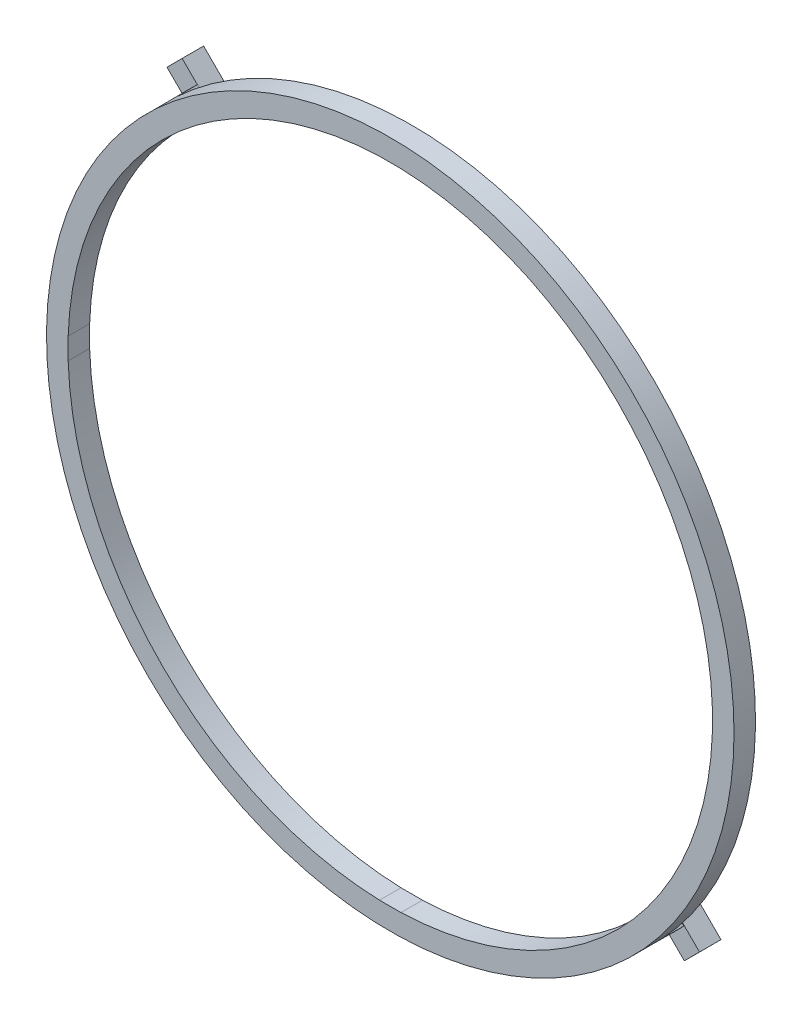
ISO-10303-21;
HEADER;
FILE_DESCRIPTION(('STEP AP214'),'2;1');
FILE_NAME('part.step','',(''),(''),'','','');
FILE_SCHEMA(('AUTOMOTIVE_DESIGN { 1 0 10303 214 1 1 1 1 }'));
ENDSEC;
DATA;
#1=APPLICATION_CONTEXT('core data for automotive mechanical design processes');
#2=APPLICATION_PROTOCOL_DEFINITION('international standard','automotive_design',2000,#1);
#3=PRODUCT_CONTEXT('',#1,'mechanical');
#4=PRODUCT('Part','Part','',(#3));
#5=PRODUCT_RELATED_PRODUCT_CATEGORY('part','',(#4));
#6=PRODUCT_DEFINITION_FORMATION('','',#4);
#7=PRODUCT_DEFINITION_CONTEXT('part definition',#1,'design');
#8=PRODUCT_DEFINITION('design','',#6,#7);
#9=PRODUCT_DEFINITION_SHAPE('','',#8);
#10=(LENGTH_UNIT() NAMED_UNIT(*) SI_UNIT(.MILLI.,.METRE.));
#11=(NAMED_UNIT(*) PLANE_ANGLE_UNIT() SI_UNIT($,.RADIAN.));
#12=(NAMED_UNIT(*) SI_UNIT($,.STERADIAN.) SOLID_ANGLE_UNIT());
#13=UNCERTAINTY_MEASURE_WITH_UNIT(LENGTH_MEASURE(1.E-05),#10,'distance_accuracy_value','');
#14=(GEOMETRIC_REPRESENTATION_CONTEXT(3) GLOBAL_UNCERTAINTY_ASSIGNED_CONTEXT((#13)) GLOBAL_UNIT_ASSIGNED_CONTEXT((#10,
#11,#12)) REPRESENTATION_CONTEXT('',''));
#15=CARTESIAN_POINT('',(0.,0.,0.));
#16=DIRECTION('',(0.,0.,1.));
#17=DIRECTION('',(1.,0.,0.));
#18=AXIS2_PLACEMENT_3D('',#15,#16,#17);
#19=CARTESIAN_POINT('',(0.,0.,-1.));
#20=DIRECTION('',(0.,0.,1.));
#21=DIRECTION('',(-1.,0.,0.));
#22=AXIS2_PLACEMENT_3D('',#19,#20,#21);
#23=PLANE('',#22);
#24=DIRECTION('',(-0.708582944932962,0.705627529331255,0.));
#25=VECTOR('',#24,1.);
#26=CARTESIAN_POINT('',(-0.352837552032621,-0.354315359463311,-1.));
#27=LINE('',#26,#25);
#28=CARTESIAN_POINT('',(10.9789516636038,-11.6388410234117,-1.));
#29=VERTEX_POINT('',#28);
#30=CARTESIAN_POINT('',(10.2699993262344,-10.932845642336,-1.));
#31=VERTEX_POINT('',#30);
#32=EDGE_CURVE('E11',#29,#31,#27,.T.);
#33=ORIENTED_EDGE('',*,*,#32,.F.);
#34=CARTESIAN_POINT('',(0.,0.,-1.));
#35=DIRECTION('',(0.,0.,1.));
#36=DIRECTION('',(-1.,0.,0.));
#37=AXIS2_PLACEMENT_3D('',#34,#35,#36);
#38=CIRCLE('',#37,16.);
#39=CARTESIAN_POINT('',(10.9546659479833,-11.6617020184918,-1.));
#40=VERTEX_POINT('',#39);
#41=EDGE_CURVE('E233',#40,#29,#38,.T.);
#42=ORIENTED_EDGE('',*,*,#41,.F.);
#43=DIRECTION('',(0.684666621748957,-0.728856376155735,0.));
#44=VECTOR('',#43,1.);
#45=CARTESIAN_POINT('',(10.9546659479833,-11.6617020184918,-1.));
#46=LINE('',#45,#44);
#47=EDGE_CURVE('E245',#31,#40,#46,.T.);
#48=ORIENTED_EDGE('',*,*,#47,.F.);
#49=EDGE_LOOP('',(#33,#42,#48));
#50=FACE_BOUND('',#49,.T.);
#51=ADVANCED_FACE('F39',(#50),#23,.F.);
#52=CARTESIAN_POINT('',(0.,0.,0.));
#53=DIRECTION('',(0.,0.,1.));
#54=DIRECTION('',(1.,0.,0.));
#55=AXIS2_PLACEMENT_3D('',#52,#53,#54);
#56=PLANE('',#55);
#57=CARTESIAN_POINT('',(0.,0.,0.));
#58=DIRECTION('',(0.,0.,1.));
#59=DIRECTION('',(1.,0.,0.));
#60=AXIS2_PLACEMENT_3D('',#57,#58,#59);
#61=CIRCLE('',#60,15.);
#62=CARTESIAN_POINT('',(0.5,-14.9916643505649,0.));
#63=VERTEX_POINT('',#62);
#64=CARTESIAN_POINT('',(10.2699993262344,-10.932845642336,0.));
#65=VERTEX_POINT('',#64);
#66=EDGE_CURVE('E392',#63,#65,#61,.T.);
#67=ORIENTED_EDGE('',*,*,#66,.T.);
#68=DIRECTION('',(0.684666621748957,-0.728856376155735,0.));
#69=VECTOR('',#68,1.);
#70=CARTESIAN_POINT('',(10.9546659479833,-11.6617020184918,0.));
#71=LINE('',#70,#69);
#72=CARTESIAN_POINT('',(10.9546659479833,-11.6617020184918,0.));
#73=VERTEX_POINT('',#72);
#74=EDGE_CURVE('E227',#65,#73,#71,.T.);
#75=ORIENTED_EDGE('',*,*,#74,.T.);
#76=CARTESIAN_POINT('',(0.,0.,0.));
#77=DIRECTION('',(0.,0.,1.));
#78=DIRECTION('',(1.,0.,0.));
#79=AXIS2_PLACEMENT_3D('',#76,#77,#78);
#80=CIRCLE('',#79,16.);
#81=CARTESIAN_POINT('',(-11.6617705183814,10.9545930265168,0.));
#82=VERTEX_POINT('',#81);
#83=EDGE_CURVE('E435',#82,#73,#80,.T.);
#84=ORIENTED_EDGE('',*,*,#83,.F.);
#85=DIRECTION('',(0.684666621748958,-0.728856376155735,0.));
#86=VECTOR('',#85,1.);
#87=CARTESIAN_POINT('',(-11.6617705183814,10.9545930265168,0.));
#88=LINE('',#87,#86);
#89=CARTESIAN_POINT('',(-10.9756744302996,10.2242149234094,0.));
#90=VERTEX_POINT('',#89);
#91=EDGE_CURVE('E310',#82,#90,#88,.T.);
#92=ORIENTED_EDGE('',*,*,#91,.T.);
#93=CARTESIAN_POINT('',(0.,0.,0.));
#94=DIRECTION('',(0.,0.,1.));
#95=DIRECTION('',(1.,0.,0.));
#96=AXIS2_PLACEMENT_3D('',#93,#94,#95);
#97=CIRCLE('',#96,15.);
#98=CARTESIAN_POINT('',(-14.9916643505649,0.499999999999996,0.));
#99=VERTEX_POINT('',#98);
#100=EDGE_CURVE('E339',#90,#99,#97,.T.);
#101=ORIENTED_EDGE('',*,*,#100,.T.);
#102=DIRECTION('',(0.,-1.,0.));
#103=VECTOR('',#102,1.);
#104=CARTESIAN_POINT('',(-14.9916643505649,-0.500000000000003,0.));
#105=LINE('',#104,#103);
#106=CARTESIAN_POINT('',(-14.9916643505649,-0.5,0.));
#107=VERTEX_POINT('',#106);
#108=EDGE_CURVE('E379',#99,#107,#105,.T.);
#109=ORIENTED_EDGE('',*,*,#108,.T.);
#110=CARTESIAN_POINT('',(0.,0.,0.));
#111=DIRECTION('',(0.,0.,1.));
#112=DIRECTION('',(1.,0.,0.));
#113=AXIS2_PLACEMENT_3D('',#110,#111,#112);
#114=CIRCLE('',#113,15.);
#115=CARTESIAN_POINT('',(-0.499999999999996,-14.9916643505649,0.));
#116=VERTEX_POINT('',#115);
#117=EDGE_CURVE('E383',#107,#116,#114,.T.);
#118=ORIENTED_EDGE('',*,*,#117,.T.);
#119=DIRECTION('',(1.,0.,0.));
#120=VECTOR('',#119,1.);
#121=CARTESIAN_POINT('',(-0.499999999999996,-14.9916643505649,0.));
#122=LINE('',#121,#120);
#123=EDGE_CURVE('E387',#116,#63,#122,.T.);
#124=ORIENTED_EDGE('',*,*,#123,.T.);
#125=EDGE_LOOP('',(#67,#75,#84,#92,#101,#109,#118,#124));
#126=FACE_BOUND('',#125,.T.);
#127=ADVANCED_FACE('F471',(#126),#56,.F.);
#128=CARTESIAN_POINT('',(0.,0.,-1.));
#129=DIRECTION('',(0.,0.,1.));
#130=DIRECTION('',(1.,0.,0.));
#131=AXIS2_PLACEMENT_3D('',#128,#129,#130);
#132=PLANE('',#131);
#133=DIRECTION('',(0.708582944932962,-0.705627529331255,0.));
#134=VECTOR('',#133,1.);
#135=CARTESIAN_POINT('',(-10.2699993262344,10.932845642336,-1.));
#136=LINE('',#135,#134);
#137=CARTESIAN_POINT('',(-10.9789516636038,11.6388410234117,-1.));
#138=VERTEX_POINT('',#137);
#139=CARTESIAN_POINT('',(-10.2699993262344,10.932845642336,-1.));
#140=VERTEX_POINT('',#139);
#141=EDGE_CURVE('E48',#138,#140,#136,.T.);
#142=ORIENTED_EDGE('',*,*,#141,.F.);
#143=CARTESIAN_POINT('',(0.,0.,-1.));
#144=DIRECTION('',(0.,0.,1.));
#145=DIRECTION('',(1.,0.,0.));
#146=AXIS2_PLACEMENT_3D('',#143,#144,#145);
#147=CIRCLE('',#146,16.);
#148=CARTESIAN_POINT('',(-10.9546659479833,11.6617020184918,-1.));
#149=VERTEX_POINT('',#148);
#150=EDGE_CURVE('E311',#149,#138,#147,.T.);
#151=ORIENTED_EDGE('',*,*,#150,.F.);
#152=DIRECTION('',(-0.684666621748957,0.728856376155735,0.));
#153=VECTOR('',#152,1.);
#154=CARTESIAN_POINT('',(-10.9546659479833,11.6617020184918,-1.));
#155=LINE('',#154,#153);
#156=EDGE_CURVE('E324',#140,#149,#155,.T.);
#157=ORIENTED_EDGE('',*,*,#156,.F.);
#158=EDGE_LOOP('',(#142,#151,#157));
#159=FACE_BOUND('',#158,.T.);
#160=ADVANCED_FACE('F533',(#159),#132,.F.);
#161=CARTESIAN_POINT('',(0.,0.,1.));
#162=DIRECTION('',(0.,0.,1.));
#163=DIRECTION('',(1.,0.,0.));
#164=AXIS2_PLACEMENT_3D('',#161,#162,#163);
#165=PLANE('',#164);
#166=CARTESIAN_POINT('',(0.,0.,1.));
#167=DIRECTION('',(0.,0.,1.));
#168=DIRECTION('',(1.,0.,0.));
#169=AXIS2_PLACEMENT_3D('',#166,#167,#168);
#170=CIRCLE('',#169,16.);
#171=CARTESIAN_POINT('',(16.,0.,1.));
#172=VERTEX_POINT('',#171);
#173=EDGE_CURVE('E432',#172,#172,#170,.T.);
#174=ORIENTED_EDGE('',*,*,#173,.T.);
#175=EDGE_LOOP('',(#174));
#176=FACE_BOUND('',#175,.T.);
#177=DIRECTION('',(0.,-1.,0.));
#178=VECTOR('',#177,1.);
#179=CARTESIAN_POINT('',(-14.9916643505649,-0.500000000000003,1.));
#180=LINE('',#179,#178);
#181=CARTESIAN_POINT('',(-14.9916643505649,0.499999999999996,1.));
#182=VERTEX_POINT('',#181);
#183=CARTESIAN_POINT('',(-14.9916643505649,-0.5,1.));
#184=VERTEX_POINT('',#183);
#185=EDGE_CURVE('E351',#182,#184,#180,.T.);
#186=ORIENTED_EDGE('',*,*,#185,.F.);
#187=CARTESIAN_POINT('',(0.,0.,1.));
#188=DIRECTION('',(0.,0.,1.));
#189=DIRECTION('',(1.,0.,0.));
#190=AXIS2_PLACEMENT_3D('',#187,#188,#189);
#191=CIRCLE('',#190,15.);
#192=CARTESIAN_POINT('',(-0.499999999999996,14.9916643505649,1.));
#193=VERTEX_POINT('',#192);
#194=EDGE_CURVE('E348',#193,#182,#191,.T.);
#195=ORIENTED_EDGE('',*,*,#194,.F.);
#196=DIRECTION('',(-1.,0.,0.));
#197=VECTOR('',#196,1.);
#198=CARTESIAN_POINT('',(-0.499999999999996,14.9916643505649,1.));
#199=LINE('',#198,#197);
#200=CARTESIAN_POINT('',(0.500000000000004,14.9916643505649,1.));
#201=VERTEX_POINT('',#200);
#202=EDGE_CURVE('E371',#201,#193,#199,.T.);
#203=ORIENTED_EDGE('',*,*,#202,.F.);
#204=CARTESIAN_POINT('',(0.,0.,1.));
#205=DIRECTION('',(0.,0.,1.));
#206=DIRECTION('',(1.,0.,0.));
#207=AXIS2_PLACEMENT_3D('',#204,#205,#206);
#208=CIRCLE('',#207,15.);
#209=CARTESIAN_POINT('',(14.9916643505649,0.499999999999996,1.));
#210=VERTEX_POINT('',#209);
#211=EDGE_CURVE('E367',#210,#201,#208,.T.);
#212=ORIENTED_EDGE('',*,*,#211,.F.);
#213=DIRECTION('',(0.,1.,0.));
#214=VECTOR('',#213,1.);
#215=CARTESIAN_POINT('',(14.9916643505649,-0.500000000000003,1.));
#216=LINE('',#215,#214);
#217=CARTESIAN_POINT('',(14.9916643505649,-0.500000000000003,1.));
#218=VERTEX_POINT('',#217);
#219=EDGE_CURVE('E364',#218,#210,#216,.T.);
#220=ORIENTED_EDGE('',*,*,#219,.F.);
#221=CARTESIAN_POINT('',(0.,0.,1.));
#222=DIRECTION('',(0.,0.,1.));
#223=DIRECTION('',(1.,0.,0.));
#224=AXIS2_PLACEMENT_3D('',#221,#222,#223);
#225=CIRCLE('',#224,15.);
#226=CARTESIAN_POINT('',(0.5,-14.9916643505649,1.));
#227=VERTEX_POINT('',#226);
#228=EDGE_CURVE('E361',#227,#218,#225,.T.);
#229=ORIENTED_EDGE('',*,*,#228,.F.);
#230=DIRECTION('',(1.,0.,0.));
#231=VECTOR('',#230,1.);
#232=CARTESIAN_POINT('',(-0.499999999999996,-14.9916643505649,1.));
#233=LINE('',#232,#231);
#234=CARTESIAN_POINT('',(-0.499999999999996,-14.9916643505649,1.));
#235=VERTEX_POINT('',#234);
#236=EDGE_CURVE('E358',#235,#227,#233,.T.);
#237=ORIENTED_EDGE('',*,*,#236,.F.);
#238=CARTESIAN_POINT('',(0.,0.,1.));
#239=DIRECTION('',(0.,0.,1.));
#240=DIRECTION('',(1.,0.,0.));
#241=AXIS2_PLACEMENT_3D('',#238,#239,#240);
#242=CIRCLE('',#241,15.);
#243=EDGE_CURVE('E355',#184,#235,#242,.T.);
#244=ORIENTED_EDGE('',*,*,#243,.F.);
#245=EDGE_LOOP('',(#186,#195,#203,#212,#220,#229,#237,#244));
#246=FACE_BOUND('',#245,.T.);
#247=ADVANCED_FACE('F460',(#176,#246),#165,.T.);
#248=CARTESIAN_POINT('',(11.6617705183814,-10.9545930265168,0.));
#249=VERTEX_POINT('',#248);
#250=CARTESIAN_POINT('',(-10.9546659479833,11.6617020184918,0.));
#251=VERTEX_POINT('',#250);
#252=EDGE_CURVE('E61',#249,#251,#80,.T.);
#253=ORIENTED_EDGE('',*,*,#252,.F.);
#254=DIRECTION('',(-0.684666621748958,0.728856376155735,0.));
#255=VECTOR('',#254,1.);
#256=CARTESIAN_POINT('',(11.6617705183814,-10.9545930265168,0.));
#257=LINE('',#256,#255);
#258=CARTESIAN_POINT('',(10.9756744302996,-10.2242149234094,0.));
#259=VERTEX_POINT('',#258);
#260=EDGE_CURVE('E223',#249,#259,#257,.T.);
#261=ORIENTED_EDGE('',*,*,#260,.T.);
#262=CARTESIAN_POINT('',(14.9916643505649,-0.500000000000003,0.));
#263=VERTEX_POINT('',#262);
#264=EDGE_CURVE('E391',#259,#263,#61,.T.);
#265=ORIENTED_EDGE('',*,*,#264,.T.);
#266=DIRECTION('',(0.,1.,0.));
#267=VECTOR('',#266,1.);
#268=CARTESIAN_POINT('',(14.9916643505649,-0.500000000000003,0.));
#269=LINE('',#268,#267);
#270=CARTESIAN_POINT('',(14.9916643505649,0.499999999999996,0.));
#271=VERTEX_POINT('',#270);
#272=EDGE_CURVE('E395',#263,#271,#269,.T.);
#273=ORIENTED_EDGE('',*,*,#272,.T.);
#274=CARTESIAN_POINT('',(0.,0.,0.));
#275=DIRECTION('',(0.,0.,1.));
#276=DIRECTION('',(1.,0.,0.));
#277=AXIS2_PLACEMENT_3D('',#274,#275,#276);
#278=CIRCLE('',#277,15.);
#279=CARTESIAN_POINT('',(0.500000000000004,14.9916643505649,0.));
#280=VERTEX_POINT('',#279);
#281=EDGE_CURVE('E399',#271,#280,#278,.T.);
#282=ORIENTED_EDGE('',*,*,#281,.T.);
#283=DIRECTION('',(-1.,0.,0.));
#284=VECTOR('',#283,1.);
#285=CARTESIAN_POINT('',(-0.499999999999996,14.9916643505649,0.));
#286=LINE('',#285,#284);
#287=CARTESIAN_POINT('',(-0.499999999999996,14.9916643505649,0.));
#288=VERTEX_POINT('',#287);
#289=EDGE_CURVE('E352',#280,#288,#286,.T.);
#290=ORIENTED_EDGE('',*,*,#289,.T.);
#291=CARTESIAN_POINT('',(-10.2699993262344,10.932845642336,0.));
#292=VERTEX_POINT('',#291);
#293=EDGE_CURVE('E375',#288,#292,#97,.T.);
#294=ORIENTED_EDGE('',*,*,#293,.T.);
#295=DIRECTION('',(-0.684666621748957,0.728856376155735,0.));
#296=VECTOR('',#295,1.);
#297=CARTESIAN_POINT('',(-10.9546659479833,11.6617020184918,0.));
#298=LINE('',#297,#296);
#299=EDGE_CURVE('E332',#292,#251,#298,.T.);
#300=ORIENTED_EDGE('',*,*,#299,.T.);
#301=EDGE_LOOP('',(#253,#261,#265,#273,#282,#290,#294,#300));
#302=FACE_BOUND('',#301,.T.);
#303=ADVANCED_FACE('F448',(#302),#56,.F.);
#304=CARTESIAN_POINT('',(0.,0.,1.));
#305=DIRECTION('',(0.,0.,-1.));
#306=DIRECTION('',(-1.,0.,0.));
#307=AXIS2_PLACEMENT_3D('',#304,#305,#306);
#308=CYLINDRICAL_SURFACE('',#307,16.);
#309=ORIENTED_EDGE('',*,*,#173,.F.);
#310=EDGE_LOOP('',(#309));
#311=FACE_BOUND('',#310,.T.);
#312=ORIENTED_EDGE('',*,*,#83,.T.);
#313=DIRECTION('',(0.,0.,1.));
#314=VECTOR('',#313,1.);
#315=CARTESIAN_POINT('',(10.9546659479833,-11.6617020184918,-1.));
#316=LINE('',#315,#314);
#317=EDGE_CURVE('E252',#40,#73,#316,.T.);
#318=ORIENTED_EDGE('',*,*,#317,.F.);
#319=ORIENTED_EDGE('',*,*,#41,.T.);
#320=CARTESIAN_POINT('',(11.6617705183814,-10.9545930265168,-1.));
#321=VERTEX_POINT('',#320);
#322=EDGE_CURVE('E237',#29,#321,#38,.T.);
#323=ORIENTED_EDGE('',*,*,#322,.T.);
#324=DIRECTION('',(0.,0.,1.));
#325=VECTOR('',#324,1.);
#326=CARTESIAN_POINT('',(11.6617705183814,-10.9545930265168,-1.));
#327=LINE('',#326,#325);
#328=EDGE_CURVE('E248',#321,#249,#327,.T.);
#329=ORIENTED_EDGE('',*,*,#328,.T.);
#330=ORIENTED_EDGE('',*,*,#252,.T.);
#331=DIRECTION('',(0.,0.,1.));
#332=VECTOR('',#331,1.);
#333=CARTESIAN_POINT('',(-10.9546659479833,11.6617020184918,-1.));
#334=LINE('',#333,#332);
#335=EDGE_CURVE('E335',#149,#251,#334,.T.);
#336=ORIENTED_EDGE('',*,*,#335,.F.);
#337=ORIENTED_EDGE('',*,*,#150,.T.);
#338=CARTESIAN_POINT('',(-11.6617705183814,10.9545930265168,-1.));
#339=VERTEX_POINT('',#338);
#340=EDGE_CURVE('E316',#138,#339,#147,.T.);
#341=ORIENTED_EDGE('',*,*,#340,.T.);
#342=DIRECTION('',(0.,0.,1.));
#343=VECTOR('',#342,1.);
#344=CARTESIAN_POINT('',(-11.6617705183814,10.9545930265168,-1.));
#345=LINE('',#344,#343);
#346=EDGE_CURVE('E328',#339,#82,#345,.T.);
#347=ORIENTED_EDGE('',*,*,#346,.T.);
#348=EDGE_LOOP('',(#312,#318,#319,#323,#329,#330,#336,#337,#341,#347));
#349=FACE_BOUND('',#348,.T.);
#350=ADVANCED_FACE('F41',(#311,#349),#308,.T.);
#351=CARTESIAN_POINT('',(0.,0.,1.));
#352=DIRECTION('',(0.,0.,-1.));
#353=DIRECTION('',(-1.,0.,0.));
#354=AXIS2_PLACEMENT_3D('',#351,#352,#353);
#355=CYLINDRICAL_SURFACE('',#354,15.);
#356=ORIENTED_EDGE('',*,*,#293,.F.);
#357=DIRECTION('',(0.,0.,-1.));
#358=VECTOR('',#357,1.);
#359=CARTESIAN_POINT('',(-0.499999999999996,14.9916643505649,1.));
#360=LINE('',#359,#358);
#361=EDGE_CURVE('E374',#193,#288,#360,.T.);
#362=ORIENTED_EDGE('',*,*,#361,.F.);
#363=ORIENTED_EDGE('',*,*,#194,.T.);
#364=DIRECTION('',(0.,0.,-1.));
#365=VECTOR('',#364,1.);
#366=CARTESIAN_POINT('',(-14.9916643505649,0.499999999999996,1.));
#367=LINE('',#366,#365);
#368=EDGE_CURVE('E428',#182,#99,#367,.T.);
#369=ORIENTED_EDGE('',*,*,#368,.T.);
#370=ORIENTED_EDGE('',*,*,#100,.F.);
#371=DIRECTION('',(0.,0.,1.));
#372=VECTOR('',#371,1.);
#373=CARTESIAN_POINT('',(-10.9756744302996,10.2242149234094,-1.));
#374=LINE('',#373,#372);
#375=CARTESIAN_POINT('',(-10.9756744302996,10.2242149234094,-1.));
#376=VERTEX_POINT('',#375);
#377=EDGE_CURVE('E343',#376,#90,#374,.T.);
#378=ORIENTED_EDGE('',*,*,#377,.F.);
#379=CARTESIAN_POINT('',(0.,0.,-1.));
#380=DIRECTION('',(0.,0.,-1.));
#381=DIRECTION('',(1.,0.,0.));
#382=AXIS2_PLACEMENT_3D('',#379,#380,#381);
#383=CIRCLE('',#382,15.);
#384=EDGE_CURVE('E320',#376,#140,#383,.T.);
#385=ORIENTED_EDGE('',*,*,#384,.T.);
#386=DIRECTION('',(0.,0.,1.));
#387=VECTOR('',#386,1.);
#388=CARTESIAN_POINT('',(-10.2699993262344,10.932845642336,-1.));
#389=LINE('',#388,#387);
#390=EDGE_CURVE('E340',#140,#292,#389,.T.);
#391=ORIENTED_EDGE('',*,*,#390,.T.);
#392=EDGE_LOOP('',(#356,#362,#363,#369,#370,#378,#385,#391));
#393=FACE_BOUND('',#392,.T.);
#394=ADVANCED_FACE('F452',(#393),#355,.F.);
#395=CARTESIAN_POINT('',(-14.9916643505649,-0.500000000000003,1.));
#396=DIRECTION('',(1.,0.,0.));
#397=DIRECTION('',(0.,0.,-1.));
#398=AXIS2_PLACEMENT_3D('',#395,#396,#397);
#399=PLANE('',#398);
#400=ORIENTED_EDGE('',*,*,#108,.F.);
#401=ORIENTED_EDGE('',*,*,#368,.F.);
#402=ORIENTED_EDGE('',*,*,#185,.T.);
#403=DIRECTION('',(0.,0.,-1.));
#404=VECTOR('',#403,1.);
#405=CARTESIAN_POINT('',(-14.9916643505649,-0.5,1.));
#406=LINE('',#405,#404);
#407=EDGE_CURVE('E425',#184,#107,#406,.T.);
#408=ORIENTED_EDGE('',*,*,#407,.T.);
#409=EDGE_LOOP('',(#400,#401,#402,#408));
#410=FACE_BOUND('',#409,.T.);
#411=ADVANCED_FACE('F467',(#410),#399,.T.);
#412=CARTESIAN_POINT('',(0.,0.,1.));
#413=DIRECTION('',(0.,0.,-1.));
#414=DIRECTION('',(-1.,0.,0.));
#415=AXIS2_PLACEMENT_3D('',#412,#413,#414);
#416=CYLINDRICAL_SURFACE('',#415,15.);
#417=ORIENTED_EDGE('',*,*,#117,.F.);
#418=ORIENTED_EDGE('',*,*,#407,.F.);
#419=ORIENTED_EDGE('',*,*,#243,.T.);
#420=DIRECTION('',(0.,0.,-1.));
#421=VECTOR('',#420,1.);
#422=CARTESIAN_POINT('',(-0.499999999999996,-14.9916643505649,1.));
#423=LINE('',#422,#421);
#424=EDGE_CURVE('E422',#235,#116,#423,.T.);
#425=ORIENTED_EDGE('',*,*,#424,.T.);
#426=EDGE_LOOP('',(#417,#418,#419,#425));
#427=FACE_BOUND('',#426,.T.);
#428=ADVANCED_FACE('F589',(#427),#416,.F.);
#429=CARTESIAN_POINT('',(-0.499999999999996,-14.9916643505649,1.));
#430=DIRECTION('',(0.,1.,0.));
#431=DIRECTION('',(0.,0.,1.));
#432=AXIS2_PLACEMENT_3D('',#429,#430,#431);
#433=PLANE('',#432);
#434=ORIENTED_EDGE('',*,*,#123,.F.);
#435=ORIENTED_EDGE('',*,*,#424,.F.);
#436=ORIENTED_EDGE('',*,*,#236,.T.);
#437=DIRECTION('',(0.,0.,-1.));
#438=VECTOR('',#437,1.);
#439=CARTESIAN_POINT('',(0.5,-14.9916643505649,1.));
#440=LINE('',#439,#438);
#441=EDGE_CURVE('E419',#227,#63,#440,.T.);
#442=ORIENTED_EDGE('',*,*,#441,.T.);
#443=EDGE_LOOP('',(#434,#435,#436,#442));
#444=FACE_BOUND('',#443,.T.);
#445=ADVANCED_FACE('F586',(#444),#433,.T.);
#446=CARTESIAN_POINT('',(0.,0.,1.));
#447=DIRECTION('',(0.,0.,-1.));
#448=DIRECTION('',(-1.,0.,0.));
#449=AXIS2_PLACEMENT_3D('',#446,#447,#448);
#450=CYLINDRICAL_SURFACE('',#449,15.);
#451=ORIENTED_EDGE('',*,*,#66,.F.);
#452=ORIENTED_EDGE('',*,*,#441,.F.);
#453=ORIENTED_EDGE('',*,*,#228,.T.);
#454=DIRECTION('',(0.,0.,-1.));
#455=VECTOR('',#454,1.);
#456=CARTESIAN_POINT('',(14.9916643505649,-0.500000000000003,1.));
#457=LINE('',#456,#455);
#458=EDGE_CURVE('E415',#218,#263,#457,.T.);
#459=ORIENTED_EDGE('',*,*,#458,.T.);
#460=ORIENTED_EDGE('',*,*,#264,.F.);
#461=DIRECTION('',(0.,0.,1.));
#462=VECTOR('',#461,1.);
#463=CARTESIAN_POINT('',(10.9756744302996,-10.2242149234094,-1.));
#464=LINE('',#463,#462);
#465=CARTESIAN_POINT('',(10.9756744302996,-10.2242149234094,-1.));
#466=VERTEX_POINT('',#465);
#467=EDGE_CURVE('E261',#466,#259,#464,.T.);
#468=ORIENTED_EDGE('',*,*,#467,.F.);
#469=CARTESIAN_POINT('',(0.,0.,-1.));
#470=DIRECTION('',(0.,0.,-1.));
#471=DIRECTION('',(-1.,0.,0.));
#472=AXIS2_PLACEMENT_3D('',#469,#470,#471);
#473=CIRCLE('',#472,15.);
#474=EDGE_CURVE('E241',#466,#31,#473,.T.);
#475=ORIENTED_EDGE('',*,*,#474,.T.);
#476=DIRECTION('',(0.,0.,1.));
#477=VECTOR('',#476,1.);
#478=CARTESIAN_POINT('',(10.2699993262344,-10.932845642336,-1.));
#479=LINE('',#478,#477);
#480=EDGE_CURVE('E257',#31,#65,#479,.T.);
#481=ORIENTED_EDGE('',*,*,#480,.T.);
#482=EDGE_LOOP('',(#451,#452,#453,#459,#460,#468,#475,#481));
#483=FACE_BOUND('',#482,.T.);
#484=ADVANCED_FACE('F513',(#483),#450,.F.);
#485=CARTESIAN_POINT('',(14.9916643505649,-0.500000000000003,1.));
#486=DIRECTION('',(-1.,0.,0.));
#487=DIRECTION('',(0.,0.,1.));
#488=AXIS2_PLACEMENT_3D('',#485,#486,#487);
#489=PLANE('',#488);
#490=ORIENTED_EDGE('',*,*,#272,.F.);
#491=ORIENTED_EDGE('',*,*,#458,.F.);
#492=ORIENTED_EDGE('',*,*,#219,.T.);
#493=DIRECTION('',(0.,0.,-1.));
#494=VECTOR('',#493,1.);
#495=CARTESIAN_POINT('',(14.9916643505649,0.499999999999996,1.));
#496=LINE('',#495,#494);
#497=EDGE_CURVE('E412',#210,#271,#496,.T.);
#498=ORIENTED_EDGE('',*,*,#497,.T.);
#499=EDGE_LOOP('',(#490,#491,#492,#498));
#500=FACE_BOUND('',#499,.T.);
#501=ADVANCED_FACE('F579',(#500),#489,.T.);
#502=CARTESIAN_POINT('',(0.,0.,1.));
#503=DIRECTION('',(0.,0.,-1.));
#504=DIRECTION('',(-1.,0.,0.));
#505=AXIS2_PLACEMENT_3D('',#502,#503,#504);
#506=CYLINDRICAL_SURFACE('',#505,15.);
#507=ORIENTED_EDGE('',*,*,#281,.F.);
#508=ORIENTED_EDGE('',*,*,#497,.F.);
#509=ORIENTED_EDGE('',*,*,#211,.T.);
#510=DIRECTION('',(0.,0.,-1.));
#511=VECTOR('',#510,1.);
#512=CARTESIAN_POINT('',(0.500000000000004,14.9916643505649,1.));
#513=LINE('',#512,#511);
#514=EDGE_CURVE('E409',#201,#280,#513,.T.);
#515=ORIENTED_EDGE('',*,*,#514,.T.);
#516=EDGE_LOOP('',(#507,#508,#509,#515));
#517=FACE_BOUND('',#516,.T.);
#518=ADVANCED_FACE('F576',(#517),#506,.F.);
#519=CARTESIAN_POINT('',(-0.499999999999996,14.9916643505649,1.));
#520=DIRECTION('',(0.,-1.,0.));
#521=DIRECTION('',(0.,0.,-1.));
#522=AXIS2_PLACEMENT_3D('',#519,#520,#521);
#523=PLANE('',#522);
#524=ORIENTED_EDGE('',*,*,#289,.F.);
#525=ORIENTED_EDGE('',*,*,#514,.F.);
#526=ORIENTED_EDGE('',*,*,#202,.T.);
#527=ORIENTED_EDGE('',*,*,#361,.T.);
#528=EDGE_LOOP('',(#524,#525,#526,#527));
#529=FACE_BOUND('',#528,.T.);
#530=ADVANCED_FACE('F455',(#529),#523,.T.);
#531=CARTESIAN_POINT('',(-10.9546659479833,11.6617020184918,-1.));
#532=DIRECTION('',(0.728856376155735,0.684666621748957,0.));
#533=DIRECTION('',(-0.684666621748957,0.728856376155735,0.));
#534=AXIS2_PLACEMENT_3D('',#531,#532,#533);
#535=PLANE('',#534);
#536=ORIENTED_EDGE('',*,*,#299,.F.);
#537=ORIENTED_EDGE('',*,*,#390,.F.);
#538=ORIENTED_EDGE('',*,*,#156,.T.);
#539=ORIENTED_EDGE('',*,*,#335,.T.);
#540=EDGE_LOOP('',(#536,#537,#538,#539));
#541=FACE_BOUND('',#540,.T.);
#542=ADVANCED_FACE('F446',(#541),#535,.T.);
#543=CARTESIAN_POINT('',(-11.6617705183814,10.9545930265168,-1.));
#544=DIRECTION('',(-0.728856376155735,-0.684666621748958,0.));
#545=DIRECTION('',(0.684666621748958,-0.728856376155735,0.));
#546=AXIS2_PLACEMENT_3D('',#543,#544,#545);
#547=PLANE('',#546);
#548=ORIENTED_EDGE('',*,*,#91,.F.);
#549=ORIENTED_EDGE('',*,*,#346,.F.);
#550=DIRECTION('',(0.684666621748958,-0.728856376155735,0.));
#551=VECTOR('',#550,1.);
#552=CARTESIAN_POINT('',(-11.6617705183814,10.9545930265168,-1.));
#553=LINE('',#552,#551);
#554=EDGE_CURVE('E315',#339,#376,#553,.T.);
#555=ORIENTED_EDGE('',*,*,#554,.T.);
#556=ORIENTED_EDGE('',*,*,#377,.T.);
#557=EDGE_LOOP('',(#548,#549,#555,#556));
#558=FACE_BOUND('',#557,.T.);
#559=ADVANCED_FACE('F570',(#558),#547,.T.);
#560=CARTESIAN_POINT('',(0.,0.,-1.));
#561=DIRECTION('',(0.,0.,-1.));
#562=DIRECTION('',(-1.,0.,0.));
#563=AXIS2_PLACEMENT_3D('',#560,#561,#562);
#564=PLANE('',#563);
#565=ORIENTED_EDGE('',*,*,#340,.F.);
#566=CARTESIAN_POINT('',(-11.6871652161003,12.3441007009985,-1.));
#567=VERTEX_POINT('',#566);
#568=EDGE_CURVE('E288',#567,#138,#136,.T.);
#569=ORIENTED_EDGE('',*,*,#568,.F.);
#570=DIRECTION('',(0.705627529331255,0.708582944932961,0.));
#571=VECTOR('',#570,1.);
#572=CARTESIAN_POINT('',(-12.3928403201655,11.6354699820719,-1.));
#573=LINE('',#572,#571);
#574=CARTESIAN_POINT('',(-12.3928403201655,11.6354699820719,-1.));
#575=VERTEX_POINT('',#574);
#576=EDGE_CURVE('E285',#575,#567,#573,.T.);
#577=ORIENTED_EDGE('',*,*,#576,.F.);
#578=DIRECTION('',(-0.708582944932961,0.705627529331256,0.));
#579=VECTOR('',#578,1.);
#580=CARTESIAN_POINT('',(-10.9756744302996,10.2242149234094,-1.));
#581=LINE('',#580,#579);
#582=EDGE_CURVE('E256',#376,#575,#581,.T.);
#583=ORIENTED_EDGE('',*,*,#582,.F.);
#584=ORIENTED_EDGE('',*,*,#554,.F.);
#585=EDGE_LOOP('',(#565,#569,#577,#583,#584));
#586=FACE_BOUND('',#585,.T.);
#587=ADVANCED_FACE('F549',(#586),#564,.F.);
#588=CARTESIAN_POINT('',(-10.9756744302996,10.2242149234094,-2.));
#589=DIRECTION('',(0.705627529331256,0.708582944932961,0.));
#590=DIRECTION('',(-0.708582944932961,0.705627529331256,0.));
#591=AXIS2_PLACEMENT_3D('',#588,#589,#590);
#592=PLANE('',#591);
#593=ORIENTED_EDGE('',*,*,#582,.T.);
#594=DIRECTION('',(0.,0.,1.));
#595=VECTOR('',#594,1.);
#596=CARTESIAN_POINT('',(-12.3928403201655,11.6354699820719,-2.));
#597=LINE('',#596,#595);
#598=CARTESIAN_POINT('',(-12.3928403201655,11.6354699820719,-2.));
#599=VERTEX_POINT('',#598);
#600=EDGE_CURVE('E306',#599,#575,#597,.T.);
#601=ORIENTED_EDGE('',*,*,#600,.F.);
#602=DIRECTION('',(-0.708582944932961,0.705627529331256,0.));
#603=VECTOR('',#602,1.);
#604=CARTESIAN_POINT('',(-10.9756744302996,10.2242149234094,-2.));
#605=LINE('',#604,#603);
#606=CARTESIAN_POINT('',(-10.9756744302996,10.2242149234094,-2.));
#607=VERTEX_POINT('',#606);
#608=EDGE_CURVE('E267',#607,#599,#605,.T.);
#609=ORIENTED_EDGE('',*,*,#608,.F.);
#610=DIRECTION('',(0.,0.,1.));
#611=VECTOR('',#610,1.);
#612=CARTESIAN_POINT('',(-10.9756744302996,10.2242149234094,-2.));
#613=LINE('',#612,#611);
#614=EDGE_CURVE('E281',#607,#376,#613,.T.);
#615=ORIENTED_EDGE('',*,*,#614,.T.);
#616=EDGE_LOOP('',(#593,#601,#609,#615));
#617=FACE_BOUND('',#616,.T.);
#618=ADVANCED_FACE('F560',(#617),#592,.F.);
#619=CARTESIAN_POINT('',(-12.3928403201655,11.6354699820719,-2.));
#620=DIRECTION('',(0.708582944932961,-0.705627529331255,0.));
#621=DIRECTION('',(0.705627529331255,0.708582944932961,0.));
#622=AXIS2_PLACEMENT_3D('',#619,#620,#621);
#623=PLANE('',#622);
#624=ORIENTED_EDGE('',*,*,#576,.T.);
#625=DIRECTION('',(0.,0.,1.));
#626=VECTOR('',#625,1.);
#627=CARTESIAN_POINT('',(-11.6871652161003,12.3441007009985,-2.));
#628=LINE('',#627,#626);
#629=CARTESIAN_POINT('',(-11.6871652161003,12.3441007009985,-2.));
#630=VERTEX_POINT('',#629);
#631=EDGE_CURVE('E302',#630,#567,#628,.T.);
#632=ORIENTED_EDGE('',*,*,#631,.F.);
#633=DIRECTION('',(0.705627529331255,0.708582944932961,0.));
#634=VECTOR('',#633,1.);
#635=CARTESIAN_POINT('',(-12.3928403201655,11.6354699820719,-2.));
#636=LINE('',#635,#634);
#637=EDGE_CURVE('E271',#599,#630,#636,.T.);
#638=ORIENTED_EDGE('',*,*,#637,.F.);
#639=ORIENTED_EDGE('',*,*,#600,.T.);
#640=EDGE_LOOP('',(#624,#632,#638,#639));
#641=FACE_BOUND('',#640,.T.);
#642=ADVANCED_FACE('F556',(#641),#623,.F.);
#643=CARTESIAN_POINT('',(-10.2699993262344,10.932845642336,-2.));
#644=DIRECTION('',(-0.705627529331255,-0.708582944932962,0.));
#645=DIRECTION('',(0.708582944932962,-0.705627529331255,0.));
#646=AXIS2_PLACEMENT_3D('',#643,#644,#645);
#647=PLANE('',#646);
#648=ORIENTED_EDGE('',*,*,#568,.T.);
#649=ORIENTED_EDGE('',*,*,#141,.T.);
#650=DIRECTION('',(0.,0.,1.));
#651=VECTOR('',#650,1.);
#652=CARTESIAN_POINT('',(-10.2699993262344,10.932845642336,-2.));
#653=LINE('',#652,#651);
#654=CARTESIAN_POINT('',(-10.2699993262344,10.932845642336,-2.));
#655=VERTEX_POINT('',#654);
#656=EDGE_CURVE('E298',#655,#140,#653,.T.);
#657=ORIENTED_EDGE('',*,*,#656,.F.);
#658=DIRECTION('',(0.708582944932962,-0.705627529331255,0.));
#659=VECTOR('',#658,1.);
#660=CARTESIAN_POINT('',(-10.2699993262344,10.932845642336,-2.));
#661=LINE('',#660,#659);
#662=EDGE_CURVE('E275',#630,#655,#661,.T.);
#663=ORIENTED_EDGE('',*,*,#662,.F.);
#664=ORIENTED_EDGE('',*,*,#631,.T.);
#665=EDGE_LOOP('',(#648,#649,#657,#663,#664));
#666=FACE_BOUND('',#665,.T.);
#667=ADVANCED_FACE('F552',(#666),#647,.F.);
#668=CARTESIAN_POINT('',(-10.9756744302996,10.2242149234094,-2.));
#669=DIRECTION('',(-0.708582944932961,0.705627529331255,0.));
#670=DIRECTION('',(-0.705627529331255,-0.708582944932961,0.));
#671=AXIS2_PLACEMENT_3D('',#668,#669,#670);
#672=PLANE('',#671);
#673=DIRECTION('',(-0.705627529331255,-0.708582944932961,0.));
#674=VECTOR('',#673,1.);
#675=CARTESIAN_POINT('',(-10.9756744302996,10.2242149234094,-1.));
#676=LINE('',#675,#674);
#677=EDGE_CURVE('E272',#140,#376,#676,.T.);
#678=ORIENTED_EDGE('',*,*,#677,.T.);
#679=ORIENTED_EDGE('',*,*,#614,.F.);
#680=DIRECTION('',(-0.705627529331255,-0.708582944932961,0.));
#681=VECTOR('',#680,1.);
#682=CARTESIAN_POINT('',(-10.9756744302996,10.2242149234094,-2.));
#683=LINE('',#682,#681);
#684=EDGE_CURVE('E278',#655,#607,#683,.T.);
#685=ORIENTED_EDGE('',*,*,#684,.F.);
#686=ORIENTED_EDGE('',*,*,#656,.T.);
#687=EDGE_LOOP('',(#678,#679,#685,#686));
#688=FACE_BOUND('',#687,.T.);
#689=ADVANCED_FACE('F544',(#688),#672,.F.);
#690=CARTESIAN_POINT('',(0.,0.,-2.));
#691=DIRECTION('',(0.,0.,-1.));
#692=DIRECTION('',(-1.,0.,0.));
#693=AXIS2_PLACEMENT_3D('',#690,#691,#692);
#694=PLANE('',#693);
#695=ORIENTED_EDGE('',*,*,#608,.T.);
#696=ORIENTED_EDGE('',*,*,#637,.T.);
#697=ORIENTED_EDGE('',*,*,#662,.T.);
#698=ORIENTED_EDGE('',*,*,#684,.T.);
#699=EDGE_LOOP('',(#695,#696,#697,#698));
#700=FACE_BOUND('',#699,.T.);
#701=ADVANCED_FACE('F541',(#700),#694,.T.);
#702=ORIENTED_EDGE('',*,*,#384,.F.);
#703=ORIENTED_EDGE('',*,*,#677,.F.);
#704=EDGE_LOOP('',(#702,#703));
#705=FACE_BOUND('',#704,.T.);
#706=ADVANCED_FACE('F538',(#705),#564,.F.);
#707=CARTESIAN_POINT('',(10.9546659479833,-11.6617020184918,-1.));
#708=DIRECTION('',(-0.728856376155735,-0.684666621748957,0.));
#709=DIRECTION('',(0.684666621748957,-0.728856376155735,0.));
#710=AXIS2_PLACEMENT_3D('',#707,#708,#709);
#711=PLANE('',#710);
#712=ORIENTED_EDGE('',*,*,#74,.F.);
#713=ORIENTED_EDGE('',*,*,#480,.F.);
#714=ORIENTED_EDGE('',*,*,#47,.T.);
#715=ORIENTED_EDGE('',*,*,#317,.T.);
#716=EDGE_LOOP('',(#712,#713,#714,#715));
#717=FACE_BOUND('',#716,.T.);
#718=ADVANCED_FACE('F516',(#717),#711,.T.);
#719=CARTESIAN_POINT('',(11.6617705183814,-10.9545930265168,-1.));
#720=DIRECTION('',(0.728856376155735,0.684666621748958,0.));
#721=DIRECTION('',(-0.684666621748958,0.728856376155735,0.));
#722=AXIS2_PLACEMENT_3D('',#719,#720,#721);
#723=PLANE('',#722);
#724=ORIENTED_EDGE('',*,*,#260,.F.);
#725=ORIENTED_EDGE('',*,*,#328,.F.);
#726=DIRECTION('',(-0.684666621748958,0.728856376155735,0.));
#727=VECTOR('',#726,1.);
#728=CARTESIAN_POINT('',(11.6617705183814,-10.9545930265168,-1.));
#729=LINE('',#728,#727);
#730=EDGE_CURVE('E236',#321,#466,#729,.T.);
#731=ORIENTED_EDGE('',*,*,#730,.T.);
#732=ORIENTED_EDGE('',*,*,#467,.T.);
#733=EDGE_LOOP('',(#724,#725,#731,#732));
#734=FACE_BOUND('',#733,.T.);
#735=ADVANCED_FACE('F482',(#734),#723,.T.);
#736=CARTESIAN_POINT('',(0.,0.,-1.));
#737=DIRECTION('',(0.,0.,-1.));
#738=DIRECTION('',(1.,0.,0.));
#739=AXIS2_PLACEMENT_3D('',#736,#737,#738);
#740=PLANE('',#739);
#741=ORIENTED_EDGE('',*,*,#730,.F.);
#742=ORIENTED_EDGE('',*,*,#322,.F.);
#743=DIRECTION('',(-0.708582944932962,0.705627529331255,0.));
#744=VECTOR('',#743,1.);
#745=CARTESIAN_POINT('',(10.2699993262344,-10.932845642336,-1.));
#746=LINE('',#745,#744);
#747=CARTESIAN_POINT('',(11.6871652161003,-12.3441007009985,-1.));
#748=VERTEX_POINT('',#747);
#749=EDGE_CURVE('E489',#748,#29,#746,.T.);
#750=ORIENTED_EDGE('',*,*,#749,.F.);
#751=DIRECTION('',(-0.705627529331255,-0.708582944932961,0.));
#752=VECTOR('',#751,1.);
#753=CARTESIAN_POINT('',(12.3928403201655,-11.6354699820719,-1.));
#754=LINE('',#753,#752);
#755=CARTESIAN_POINT('',(12.3928403201655,-11.6354699820719,-1.));
#756=VERTEX_POINT('',#755);
#757=EDGE_CURVE('E485',#756,#748,#754,.T.);
#758=ORIENTED_EDGE('',*,*,#757,.F.);
#759=DIRECTION('',(0.708582944932961,-0.705627529331256,0.));
#760=VECTOR('',#759,1.);
#761=CARTESIAN_POINT('',(10.9756744302996,-10.2242149234094,-1.));
#762=LINE('',#761,#760);
#763=EDGE_CURVE('E221',#466,#756,#762,.T.);
#764=ORIENTED_EDGE('',*,*,#763,.F.);
#765=EDGE_LOOP('',(#741,#742,#750,#758,#764));
#766=FACE_BOUND('',#765,.T.);
#767=ADVANCED_FACE('F484',(#766),#740,.F.);
#768=CARTESIAN_POINT('',(10.9756744302996,-10.2242149234094,-2.));
#769=DIRECTION('',(-0.705627529331256,-0.708582944932961,0.));
#770=DIRECTION('',(0.708582944932961,-0.705627529331256,0.));
#771=AXIS2_PLACEMENT_3D('',#768,#769,#770);
#772=PLANE('',#771);
#773=ORIENTED_EDGE('',*,*,#763,.T.);
#774=DIRECTION('',(0.,0.,1.));
#775=VECTOR('',#774,1.);
#776=CARTESIAN_POINT('',(12.3928403201655,-11.6354699820719,-2.));
#777=LINE('',#776,#775);
#778=CARTESIAN_POINT('',(12.3928403201655,-11.6354699820719,-2.));
#779=VERTEX_POINT('',#778);
#780=EDGE_CURVE('E199',#779,#756,#777,.T.);
#781=ORIENTED_EDGE('',*,*,#780,.F.);
#782=DIRECTION('',(0.708582944932961,-0.705627529331256,0.));
#783=VECTOR('',#782,1.);
#784=CARTESIAN_POINT('',(10.9756744302996,-10.2242149234094,-2.));
#785=LINE('',#784,#783);
#786=CARTESIAN_POINT('',(10.9756744302996,-10.2242149234094,-2.));
#787=VERTEX_POINT('',#786);
#788=EDGE_CURVE('E207',#787,#779,#785,.T.);
#789=ORIENTED_EDGE('',*,*,#788,.F.);
#790=DIRECTION('',(0.,0.,1.));
#791=VECTOR('',#790,1.);
#792=CARTESIAN_POINT('',(10.9756744302996,-10.2242149234094,-2.));
#793=LINE('',#792,#791);
#794=EDGE_CURVE('E499',#787,#466,#793,.T.);
#795=ORIENTED_EDGE('',*,*,#794,.T.);
#796=EDGE_LOOP('',(#773,#781,#789,#795));
#797=FACE_BOUND('',#796,.T.);
#798=ADVANCED_FACE('F219',(#797),#772,.F.);
#799=CARTESIAN_POINT('',(12.3928403201655,-11.6354699820719,-2.));
#800=DIRECTION('',(-0.708582944932961,0.705627529331255,0.));
#801=DIRECTION('',(-0.705627529331255,-0.708582944932961,0.));
#802=AXIS2_PLACEMENT_3D('',#799,#800,#801);
#803=PLANE('',#802);
#804=ORIENTED_EDGE('',*,*,#757,.T.);
#805=DIRECTION('',(0.,0.,1.));
#806=VECTOR('',#805,1.);
#807=CARTESIAN_POINT('',(11.6871652161003,-12.3441007009985,-2.));
#808=LINE('',#807,#806);
#809=CARTESIAN_POINT('',(11.6871652161003,-12.3441007009985,-2.));
#810=VERTEX_POINT('',#809);
#811=EDGE_CURVE('E202',#810,#748,#808,.T.);
#812=ORIENTED_EDGE('',*,*,#811,.F.);
#813=DIRECTION('',(-0.705627529331255,-0.708582944932961,0.));
#814=VECTOR('',#813,1.);
#815=CARTESIAN_POINT('',(12.3928403201655,-11.6354699820719,-2.));
#816=LINE('',#815,#814);
#817=EDGE_CURVE('E195',#779,#810,#816,.T.);
#818=ORIENTED_EDGE('',*,*,#817,.F.);
#819=ORIENTED_EDGE('',*,*,#780,.T.);
#820=EDGE_LOOP('',(#804,#812,#818,#819));
#821=FACE_BOUND('',#820,.T.);
#822=ADVANCED_FACE('F197',(#821),#803,.F.);
#823=CARTESIAN_POINT('',(10.2699993262344,-10.932845642336,-2.));
#824=DIRECTION('',(0.705627529331255,0.708582944932962,0.));
#825=DIRECTION('',(-0.708582944932962,0.705627529331255,0.));
#826=AXIS2_PLACEMENT_3D('',#823,#824,#825);
#827=PLANE('',#826);
#828=ORIENTED_EDGE('',*,*,#749,.T.);
#829=ORIENTED_EDGE('',*,*,#32,.T.);
#830=DIRECTION('',(0.,0.,1.));
#831=VECTOR('',#830,1.);
#832=CARTESIAN_POINT('',(10.2699993262344,-10.932845642336,-2.));
#833=LINE('',#832,#831);
#834=CARTESIAN_POINT('',(10.2699993262344,-10.932845642336,-2.));
#835=VERTEX_POINT('',#834);
#836=EDGE_CURVE('E229',#835,#31,#833,.T.);
#837=ORIENTED_EDGE('',*,*,#836,.F.);
#838=DIRECTION('',(-0.708582944932962,0.705627529331255,0.));
#839=VECTOR('',#838,1.);
#840=CARTESIAN_POINT('',(10.2699993262344,-10.932845642336,-2.));
#841=LINE('',#840,#839);
#842=EDGE_CURVE('E206',#810,#835,#841,.T.);
#843=ORIENTED_EDGE('',*,*,#842,.F.);
#844=ORIENTED_EDGE('',*,*,#811,.T.);
#845=EDGE_LOOP('',(#828,#829,#837,#843,#844));
#846=FACE_BOUND('',#845,.T.);
#847=ADVANCED_FACE('F517',(#846),#827,.F.);
#848=CARTESIAN_POINT('',(10.9756744302996,-10.2242149234094,-2.));
#849=DIRECTION('',(0.708582944932961,-0.705627529331255,0.));
#850=DIRECTION('',(0.705627529331255,0.708582944932961,0.));
#851=AXIS2_PLACEMENT_3D('',#848,#849,#850);
#852=PLANE('',#851);
#853=DIRECTION('',(0.705627529331255,0.708582944932961,0.));
#854=VECTOR('',#853,1.);
#855=CARTESIAN_POINT('',(10.9756744302996,-10.2242149234094,-1.));
#856=LINE('',#855,#854);
#857=EDGE_CURVE('E217',#31,#466,#856,.T.);
#858=ORIENTED_EDGE('',*,*,#857,.T.);
#859=ORIENTED_EDGE('',*,*,#794,.F.);
#860=DIRECTION('',(0.705627529331255,0.708582944932961,0.));
#861=VECTOR('',#860,1.);
#862=CARTESIAN_POINT('',(10.9756744302996,-10.2242149234094,-2.));
#863=LINE('',#862,#861);
#864=EDGE_CURVE('E212',#835,#787,#863,.T.);
#865=ORIENTED_EDGE('',*,*,#864,.F.);
#866=ORIENTED_EDGE('',*,*,#836,.T.);
#867=EDGE_LOOP('',(#858,#859,#865,#866));
#868=FACE_BOUND('',#867,.T.);
#869=ADVANCED_FACE('F506',(#868),#852,.F.);
#870=CARTESIAN_POINT('',(0.,0.,-2.));
#871=DIRECTION('',(0.,0.,-1.));
#872=DIRECTION('',(1.,0.,0.));
#873=AXIS2_PLACEMENT_3D('',#870,#871,#872);
#874=PLANE('',#873);
#875=ORIENTED_EDGE('',*,*,#788,.T.);
#876=ORIENTED_EDGE('',*,*,#817,.T.);
#877=ORIENTED_EDGE('',*,*,#842,.T.);
#878=ORIENTED_EDGE('',*,*,#864,.T.);
#879=EDGE_LOOP('',(#875,#876,#877,#878));
#880=FACE_BOUND('',#879,.T.);
#881=ADVANCED_FACE('F210',(#880),#874,.T.);
#882=ORIENTED_EDGE('',*,*,#474,.F.);
#883=ORIENTED_EDGE('',*,*,#857,.F.);
#884=EDGE_LOOP('',(#882,#883));
#885=FACE_BOUND('',#884,.T.);
#886=ADVANCED_FACE('F509',(#885),#740,.F.);
#887=CLOSED_SHELL('',(#51,#127,#160,#247,#303,#350,#394,#411,#428,#445,#484,#501,#518,#530,#542,
#559,#587,#618,#642,#667,#689,#701,#706,#718,#735,#767,#798,#822,#847,#869,#881,#886));
#888=MANIFOLD_SOLID_BREP('B2',#887);
#889=ADVANCED_BREP_SHAPE_REPRESENTATION('',(#18,#888),#14);
#890=SHAPE_DEFINITION_REPRESENTATION(#9,#889);
ENDSEC;
END-ISO-10303-21;
